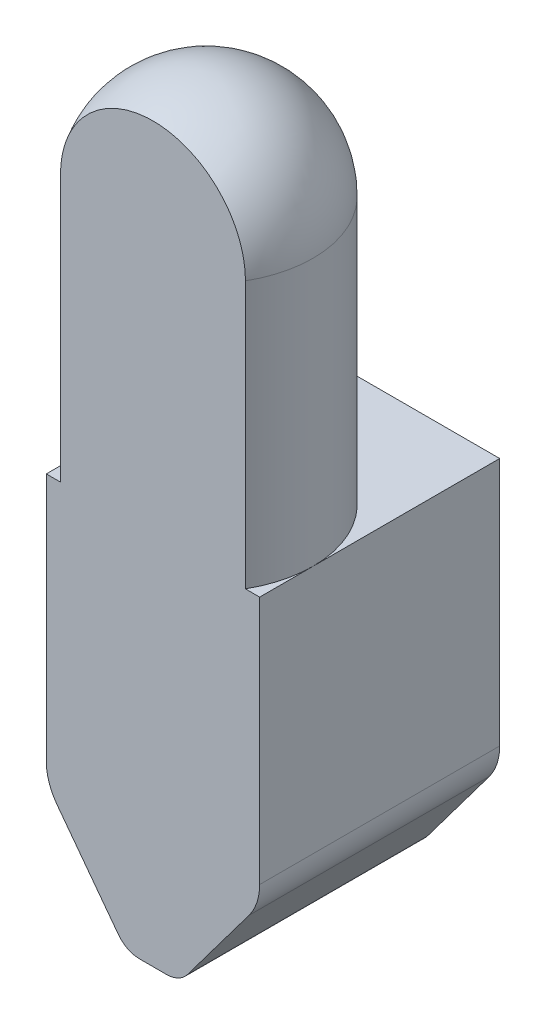
ISO-10303-21;
HEADER;
FILE_DESCRIPTION(('STEP AP214'),'2;1');
FILE_NAME('part.step','',(''),(''),'','','');
FILE_SCHEMA(('AUTOMOTIVE_DESIGN { 1 0 10303 214 1 1 1 1 }'));
ENDSEC;
DATA;
#1=APPLICATION_CONTEXT('core data for automotive mechanical design processes');
#2=APPLICATION_PROTOCOL_DEFINITION('international standard','automotive_design',2000,#1);
#3=PRODUCT_CONTEXT('',#1,'mechanical');
#4=PRODUCT('Part','Part','',(#3));
#5=PRODUCT_RELATED_PRODUCT_CATEGORY('part','',(#4));
#6=PRODUCT_DEFINITION_FORMATION('','',#4);
#7=PRODUCT_DEFINITION_CONTEXT('part definition',#1,'design');
#8=PRODUCT_DEFINITION('design','',#6,#7);
#9=PRODUCT_DEFINITION_SHAPE('','',#8);
#10=(LENGTH_UNIT() NAMED_UNIT(*) SI_UNIT(.MILLI.,.METRE.));
#11=(NAMED_UNIT(*) PLANE_ANGLE_UNIT() SI_UNIT($,.RADIAN.));
#12=(NAMED_UNIT(*) SI_UNIT($,.STERADIAN.) SOLID_ANGLE_UNIT());
#13=UNCERTAINTY_MEASURE_WITH_UNIT(LENGTH_MEASURE(1.E-05),#10,'distance_accuracy_value','');
#14=(GEOMETRIC_REPRESENTATION_CONTEXT(3) GLOBAL_UNCERTAINTY_ASSIGNED_CONTEXT((#13)) GLOBAL_UNIT_ASSIGNED_CONTEXT((#10,
#11,#12)) REPRESENTATION_CONTEXT('',''));
#15=CARTESIAN_POINT('',(0.,0.,0.));
#16=DIRECTION('',(0.,0.,1.));
#17=DIRECTION('',(1.,0.,0.));
#18=AXIS2_PLACEMENT_3D('',#15,#16,#17);
#19=CARTESIAN_POINT('',(-2.,5.,-4.5));
#20=DIRECTION('',(0.,1.,0.));
#21=DIRECTION('',(0.,0.,1.));
#22=AXIS2_PLACEMENT_3D('',#19,#20,#21);
#23=PLANE('',#22);
#24=CARTESIAN_POINT('',(0.,5.,-1.));
#25=DIRECTION('',(0.,1.,0.));
#26=DIRECTION('',(0.,0.,1.));
#27=AXIS2_PLACEMENT_3D('',#24,#25,#26);
#28=CIRCLE('',#27,2.);
#29=CARTESIAN_POINT('',(1.73205080756888,5.,0.));
#30=VERTEX_POINT('',#29);
#31=CARTESIAN_POINT('',(2.,5.,-1.));
#32=VERTEX_POINT('',#31);
#33=EDGE_CURVE('E154',#30,#32,#28,.T.);
#34=ORIENTED_EDGE('',*,*,#33,.F.);
#35=DIRECTION('',(-1.,0.,0.));
#36=VECTOR('',#35,1.);
#37=CARTESIAN_POINT('',(-2.,5.,0.));
#38=LINE('',#37,#36);
#39=CARTESIAN_POINT('',(2.,5.,0.));
#40=VERTEX_POINT('',#39);
#41=EDGE_CURVE('E147',#40,#30,#38,.T.);
#42=ORIENTED_EDGE('',*,*,#41,.F.);
#43=DIRECTION('',(0.,0.,1.));
#44=VECTOR('',#43,1.);
#45=CARTESIAN_POINT('',(2.,5.,-4.5));
#46=LINE('',#45,#44);
#47=EDGE_CURVE('E193',#32,#40,#46,.T.);
#48=ORIENTED_EDGE('',*,*,#47,.F.);
#49=EDGE_LOOP('',(#34,#42,#48));
#50=FACE_BOUND('',#49,.T.);
#51=ADVANCED_FACE('F36',(#50),#23,.T.);
#52=CARTESIAN_POINT('',(-2.,5.,-1.));
#53=VERTEX_POINT('',#52);
#54=EDGE_CURVE('E139',#32,#53,#28,.T.);
#55=ORIENTED_EDGE('',*,*,#54,.F.);
#56=CARTESIAN_POINT('',(2.,5.,-4.5));
#57=VERTEX_POINT('',#56);
#58=EDGE_CURVE('E190',#57,#32,#46,.T.);
#59=ORIENTED_EDGE('',*,*,#58,.F.);
#60=DIRECTION('',(-1.,0.,0.));
#61=VECTOR('',#60,1.);
#62=CARTESIAN_POINT('',(-2.,5.,-4.5));
#63=LINE('',#62,#61);
#64=CARTESIAN_POINT('',(-2.,5.,-4.5));
#65=VERTEX_POINT('',#64);
#66=EDGE_CURVE('E161',#57,#65,#63,.T.);
#67=ORIENTED_EDGE('',*,*,#66,.T.);
#68=DIRECTION('',(0.,0.,1.));
#69=VECTOR('',#68,1.);
#70=CARTESIAN_POINT('',(-2.,5.,-4.5));
#71=LINE('',#70,#69);
#72=EDGE_CURVE('E194',#65,#53,#71,.T.);
#73=ORIENTED_EDGE('',*,*,#72,.T.);
#74=EDGE_LOOP('',(#55,#59,#67,#73));
#75=FACE_BOUND('',#74,.T.);
#76=ADVANCED_FACE('F261',(#75),#23,.T.);
#77=CARTESIAN_POINT('',(-1.73205080756888,5.,0.));
#78=VERTEX_POINT('',#77);
#79=EDGE_CURVE('E157',#53,#78,#28,.T.);
#80=ORIENTED_EDGE('',*,*,#79,.F.);
#81=CARTESIAN_POINT('',(-2.,5.,0.));
#82=VERTEX_POINT('',#81);
#83=EDGE_CURVE('E177',#53,#82,#71,.T.);
#84=ORIENTED_EDGE('',*,*,#83,.T.);
#85=EDGE_CURVE('E160',#78,#82,#38,.T.);
#86=ORIENTED_EDGE('',*,*,#85,.F.);
#87=EDGE_LOOP('',(#80,#84,#86));
#88=FACE_BOUND('',#87,.T.);
#89=ADVANCED_FACE('F273',(#88),#23,.T.);
#90=CARTESIAN_POINT('',(2.,0.,-4.5));
#91=DIRECTION('',(1.,0.,0.));
#92=DIRECTION('',(0.,1.,0.));
#93=AXIS2_PLACEMENT_3D('',#90,#91,#92);
#94=PLANE('',#93);
#95=DIRECTION('',(0.,1.,0.));
#96=VECTOR('',#95,1.);
#97=CARTESIAN_POINT('',(2.,0.,0.));
#98=LINE('',#97,#96);
#99=CARTESIAN_POINT('',(2.,0.333333333333333,0.));
#100=VERTEX_POINT('',#99);
#101=EDGE_CURVE('E165',#100,#40,#98,.T.);
#102=ORIENTED_EDGE('',*,*,#101,.F.);
#103=DIRECTION('',(0.,0.,1.));
#104=VECTOR('',#103,1.);
#105=CARTESIAN_POINT('',(2.,0.333333333333333,-4.5));
#106=LINE('',#105,#104);
#107=CARTESIAN_POINT('',(2.,0.333333333333333,-4.5));
#108=VERTEX_POINT('',#107);
#109=EDGE_CURVE('E213',#100,#108,#106,.F.);
#110=ORIENTED_EDGE('',*,*,#109,.T.);
#111=DIRECTION('',(0.,1.,0.));
#112=VECTOR('',#111,1.);
#113=CARTESIAN_POINT('',(2.,0.,-4.5));
#114=LINE('',#113,#112);
#115=EDGE_CURVE('E175',#108,#57,#114,.T.);
#116=ORIENTED_EDGE('',*,*,#115,.T.);
#117=ORIENTED_EDGE('',*,*,#58,.T.);
#118=ORIENTED_EDGE('',*,*,#47,.T.);
#119=EDGE_LOOP('',(#102,#110,#116,#117,#118));
#120=FACE_BOUND('',#119,.T.);
#121=ADVANCED_FACE('F254',(#120),#94,.T.);
#122=CARTESIAN_POINT('',(0.5,-2.,-4.5));
#123=DIRECTION('',(0.8,-0.6,0.));
#124=DIRECTION('',(0.6,0.8,0.));
#125=AXIS2_PLACEMENT_3D('',#122,#123,#124);
#126=PLANE('',#125);
#127=DIRECTION('',(0.6,0.8,0.));
#128=VECTOR('',#127,1.);
#129=CARTESIAN_POINT('',(0.5,-2.,0.));
#130=LINE('',#129,#128);
#131=CARTESIAN_POINT('',(0.65,-1.8,0.));
#132=VERTEX_POINT('',#131);
#133=CARTESIAN_POINT('',(1.8,-0.266666666666667,0.));
#134=VERTEX_POINT('',#133);
#135=EDGE_CURVE('E187',#132,#134,#130,.T.);
#136=ORIENTED_EDGE('',*,*,#135,.F.);
#137=DIRECTION('',(0.,0.,1.));
#138=VECTOR('',#137,1.);
#139=CARTESIAN_POINT('',(0.65,-1.8,-4.5));
#140=LINE('',#139,#138);
#141=CARTESIAN_POINT('',(0.65,-1.8,-4.5));
#142=VERTEX_POINT('',#141);
#143=EDGE_CURVE('E11',#132,#142,#140,.F.);
#144=ORIENTED_EDGE('',*,*,#143,.T.);
#145=DIRECTION('',(0.6,0.8,0.));
#146=VECTOR('',#145,1.);
#147=CARTESIAN_POINT('',(0.5,-2.,-4.5));
#148=LINE('',#147,#146);
#149=CARTESIAN_POINT('',(1.8,-0.266666666666667,-4.5));
#150=VERTEX_POINT('',#149);
#151=EDGE_CURVE('E173',#142,#150,#148,.T.);
#152=ORIENTED_EDGE('',*,*,#151,.T.);
#153=DIRECTION('',(0.,0.,1.));
#154=VECTOR('',#153,1.);
#155=CARTESIAN_POINT('',(1.8,-0.266666666666667,-4.5));
#156=LINE('',#155,#154);
#157=EDGE_CURVE('E210',#150,#134,#156,.T.);
#158=ORIENTED_EDGE('',*,*,#157,.T.);
#159=EDGE_LOOP('',(#136,#144,#152,#158));
#160=FACE_BOUND('',#159,.T.);
#161=ADVANCED_FACE('F245',(#160),#126,.T.);
#162=CARTESIAN_POINT('',(-0.5,-2.,-4.5));
#163=DIRECTION('',(0.,-1.,0.));
#164=DIRECTION('',(0.,0.,-1.));
#165=AXIS2_PLACEMENT_3D('',#162,#163,#164);
#166=PLANE('',#165);
#167=DIRECTION('',(1.,0.,0.));
#168=VECTOR('',#167,1.);
#169=CARTESIAN_POINT('',(-0.5,-2.,0.));
#170=LINE('',#169,#168);
#171=CARTESIAN_POINT('',(-0.25,-2.,0.));
#172=VERTEX_POINT('',#171);
#173=CARTESIAN_POINT('',(0.25,-2.,0.));
#174=VERTEX_POINT('',#173);
#175=EDGE_CURVE('E184',#172,#174,#170,.T.);
#176=ORIENTED_EDGE('',*,*,#175,.F.);
#177=DIRECTION('',(0.,0.,1.));
#178=VECTOR('',#177,1.);
#179=CARTESIAN_POINT('',(-0.25,-2.,-4.5));
#180=LINE('',#179,#178);
#181=CARTESIAN_POINT('',(-0.25,-2.,-4.5));
#182=VERTEX_POINT('',#181);
#183=EDGE_CURVE('E225',#172,#182,#180,.F.);
#184=ORIENTED_EDGE('',*,*,#183,.T.);
#185=DIRECTION('',(1.,0.,0.));
#186=VECTOR('',#185,1.);
#187=CARTESIAN_POINT('',(-0.5,-2.,-4.5));
#188=LINE('',#187,#186);
#189=CARTESIAN_POINT('',(0.25,-2.,-4.5));
#190=VERTEX_POINT('',#189);
#191=EDGE_CURVE('E171',#182,#190,#188,.T.);
#192=ORIENTED_EDGE('',*,*,#191,.T.);
#193=DIRECTION('',(0.,0.,1.));
#194=VECTOR('',#193,1.);
#195=CARTESIAN_POINT('',(0.25,-2.,-4.5));
#196=LINE('',#195,#194);
#197=EDGE_CURVE('E222',#190,#174,#196,.T.);
#198=ORIENTED_EDGE('',*,*,#197,.T.);
#199=EDGE_LOOP('',(#176,#184,#192,#198));
#200=FACE_BOUND('',#199,.T.);
#201=ADVANCED_FACE('F241',(#200),#166,.T.);
#202=CARTESIAN_POINT('',(-0.5,-2.,-4.5));
#203=DIRECTION('',(-0.8,-0.6,0.));
#204=DIRECTION('',(0.6,-0.8,0.));
#205=AXIS2_PLACEMENT_3D('',#202,#203,#204);
#206=PLANE('',#205);
#207=DIRECTION('',(0.6,-0.8,0.));
#208=VECTOR('',#207,1.);
#209=CARTESIAN_POINT('',(-0.5,-2.,-4.5));
#210=LINE('',#209,#208);
#211=CARTESIAN_POINT('',(-1.8,-0.266666666666667,-4.5));
#212=VERTEX_POINT('',#211);
#213=CARTESIAN_POINT('',(-0.65,-1.8,-4.5));
#214=VERTEX_POINT('',#213);
#215=EDGE_CURVE('E168',#212,#214,#210,.T.);
#216=ORIENTED_EDGE('',*,*,#215,.T.);
#217=DIRECTION('',(0.,0.,1.));
#218=VECTOR('',#217,1.);
#219=CARTESIAN_POINT('',(-0.65,-1.8,-4.5));
#220=LINE('',#219,#218);
#221=CARTESIAN_POINT('',(-0.65,-1.8,0.));
#222=VERTEX_POINT('',#221);
#223=EDGE_CURVE('E215',#214,#222,#220,.T.);
#224=ORIENTED_EDGE('',*,*,#223,.T.);
#225=DIRECTION('',(0.6,-0.8,0.));
#226=VECTOR('',#225,1.);
#227=CARTESIAN_POINT('',(-0.5,-2.,0.));
#228=LINE('',#227,#226);
#229=CARTESIAN_POINT('',(-1.8,-0.266666666666667,0.));
#230=VERTEX_POINT('',#229);
#231=EDGE_CURVE('E182',#230,#222,#228,.T.);
#232=ORIENTED_EDGE('',*,*,#231,.F.);
#233=DIRECTION('',(0.,0.,1.));
#234=VECTOR('',#233,1.);
#235=CARTESIAN_POINT('',(-1.8,-0.266666666666667,-4.5));
#236=LINE('',#235,#234);
#237=EDGE_CURVE('E203',#230,#212,#236,.F.);
#238=ORIENTED_EDGE('',*,*,#237,.T.);
#239=EDGE_LOOP('',(#216,#224,#232,#238));
#240=FACE_BOUND('',#239,.T.);
#241=ADVANCED_FACE('F235',(#240),#206,.T.);
#242=CARTESIAN_POINT('',(-2.,0.,-4.5));
#243=DIRECTION('',(-1.,0.,0.));
#244=DIRECTION('',(0.,-1.,0.));
#245=AXIS2_PLACEMENT_3D('',#242,#243,#244);
#246=PLANE('',#245);
#247=DIRECTION('',(0.,-1.,0.));
#248=VECTOR('',#247,1.);
#249=CARTESIAN_POINT('',(-2.,0.,-4.5));
#250=LINE('',#249,#248);
#251=CARTESIAN_POINT('',(-2.,0.333333333333333,-4.5));
#252=VERTEX_POINT('',#251);
#253=EDGE_CURVE('E164',#65,#252,#250,.T.);
#254=ORIENTED_EDGE('',*,*,#253,.T.);
#255=DIRECTION('',(0.,0.,1.));
#256=VECTOR('',#255,1.);
#257=CARTESIAN_POINT('',(-2.,0.333333333333333,-4.5));
#258=LINE('',#257,#256);
#259=CARTESIAN_POINT('',(-2.,0.333333333333333,0.));
#260=VERTEX_POINT('',#259);
#261=EDGE_CURVE('E138',#252,#260,#258,.T.);
#262=ORIENTED_EDGE('',*,*,#261,.T.);
#263=DIRECTION('',(0.,-1.,0.));
#264=VECTOR('',#263,1.);
#265=CARTESIAN_POINT('',(-2.,0.,0.));
#266=LINE('',#265,#264);
#267=EDGE_CURVE('E179',#82,#260,#266,.T.);
#268=ORIENTED_EDGE('',*,*,#267,.F.);
#269=ORIENTED_EDGE('',*,*,#83,.F.);
#270=ORIENTED_EDGE('',*,*,#72,.F.);
#271=EDGE_LOOP('',(#254,#262,#268,#269,#270));
#272=FACE_BOUND('',#271,.T.);
#273=ADVANCED_FACE('F266',(#272),#246,.T.);
#274=CARTESIAN_POINT('',(0.,0.,-4.5));
#275=DIRECTION('',(0.,0.,1.));
#276=DIRECTION('',(1.,0.,0.));
#277=AXIS2_PLACEMENT_3D('',#274,#275,#276);
#278=PLANE('',#277);
#279=ORIENTED_EDGE('',*,*,#191,.F.);
#280=CARTESIAN_POINT('',(-0.25,-1.5,-4.5));
#281=DIRECTION('',(0.,0.,1.));
#282=DIRECTION('',(1.,0.,0.));
#283=AXIS2_PLACEMENT_3D('',#280,#281,#282);
#284=CIRCLE('',#283,0.5);
#285=EDGE_CURVE('E44',#182,#214,#284,.F.);
#286=ORIENTED_EDGE('',*,*,#285,.T.);
#287=ORIENTED_EDGE('',*,*,#215,.F.);
#288=CARTESIAN_POINT('',(-1.,0.333333333333333,-4.5));
#289=DIRECTION('',(0.,0.,1.));
#290=DIRECTION('',(1.,0.,0.));
#291=AXIS2_PLACEMENT_3D('',#288,#289,#290);
#292=CIRCLE('',#291,1.);
#293=EDGE_CURVE('E208',#212,#252,#292,.F.);
#294=ORIENTED_EDGE('',*,*,#293,.T.);
#295=ORIENTED_EDGE('',*,*,#253,.F.);
#296=ORIENTED_EDGE('',*,*,#66,.F.);
#297=ORIENTED_EDGE('',*,*,#115,.F.);
#298=CARTESIAN_POINT('',(1.,0.333333333333333,-4.5));
#299=DIRECTION('',(0.,0.,1.));
#300=DIRECTION('',(1.,0.,0.));
#301=AXIS2_PLACEMENT_3D('',#298,#299,#300);
#302=CIRCLE('',#301,1.);
#303=EDGE_CURVE('E205',#108,#150,#302,.F.);
#304=ORIENTED_EDGE('',*,*,#303,.T.);
#305=ORIENTED_EDGE('',*,*,#151,.F.);
#306=CARTESIAN_POINT('',(0.25,-1.5,-4.5));
#307=DIRECTION('',(0.,0.,1.));
#308=DIRECTION('',(1.,0.,0.));
#309=AXIS2_PLACEMENT_3D('',#306,#307,#308);
#310=CIRCLE('',#309,0.5);
#311=EDGE_CURVE('E56',#142,#190,#310,.F.);
#312=ORIENTED_EDGE('',*,*,#311,.T.);
#313=EDGE_LOOP('',(#279,#286,#287,#294,#295,#296,#297,#304,#305,#312));
#314=FACE_BOUND('',#313,.T.);
#315=ADVANCED_FACE('F229',(#314),#278,.F.);
#316=CARTESIAN_POINT('',(0.,0.,0.));
#317=DIRECTION('',(0.,0.,1.));
#318=DIRECTION('',(1.,0.,0.));
#319=AXIS2_PLACEMENT_3D('',#316,#317,#318);
#320=PLANE('',#319);
#321=ORIENTED_EDGE('',*,*,#231,.T.);
#322=CARTESIAN_POINT('',(-0.25,-1.5,0.));
#323=DIRECTION('',(0.,0.,1.));
#324=DIRECTION('',(1.,0.,0.));
#325=AXIS2_PLACEMENT_3D('',#322,#323,#324);
#326=CIRCLE('',#325,0.5);
#327=EDGE_CURVE('E220',#222,#172,#326,.T.);
#328=ORIENTED_EDGE('',*,*,#327,.T.);
#329=ORIENTED_EDGE('',*,*,#175,.T.);
#330=CARTESIAN_POINT('',(0.25,-1.5,0.));
#331=DIRECTION('',(0.,0.,1.));
#332=DIRECTION('',(1.,0.,0.));
#333=AXIS2_PLACEMENT_3D('',#330,#331,#332);
#334=CIRCLE('',#333,0.5);
#335=EDGE_CURVE('E218',#174,#132,#334,.T.);
#336=ORIENTED_EDGE('',*,*,#335,.T.);
#337=ORIENTED_EDGE('',*,*,#135,.T.);
#338=CARTESIAN_POINT('',(1.,0.333333333333333,0.));
#339=DIRECTION('',(0.,0.,1.));
#340=DIRECTION('',(1.,0.,0.));
#341=AXIS2_PLACEMENT_3D('',#338,#339,#340);
#342=CIRCLE('',#341,1.);
#343=EDGE_CURVE('E199',#134,#100,#342,.T.);
#344=ORIENTED_EDGE('',*,*,#343,.T.);
#345=ORIENTED_EDGE('',*,*,#101,.T.);
#346=ORIENTED_EDGE('',*,*,#41,.T.);
#347=DIRECTION('',(0.,-1.,0.));
#348=VECTOR('',#347,1.);
#349=CARTESIAN_POINT('',(1.73205080756888,10.,0.));
#350=LINE('',#349,#348);
#351=CARTESIAN_POINT('',(1.73205080756888,10.,0.));
#352=VERTEX_POINT('',#351);
#353=EDGE_CURVE('E143',#352,#30,#350,.T.);
#354=ORIENTED_EDGE('',*,*,#353,.F.);
#355=CARTESIAN_POINT('',(0.,10.,0.));
#356=DIRECTION('',(0.,0.,-1.));
#357=DIRECTION('',(-1.,0.,0.));
#358=AXIS2_PLACEMENT_3D('',#355,#356,#357);
#359=CIRCLE('',#358,1.73205080756888);
#360=CARTESIAN_POINT('',(-1.73205080756888,10.,0.));
#361=VERTEX_POINT('',#360);
#362=EDGE_CURVE('E130',#361,#352,#359,.T.);
#363=ORIENTED_EDGE('',*,*,#362,.F.);
#364=DIRECTION('',(0.,-1.,0.));
#365=VECTOR('',#364,1.);
#366=CARTESIAN_POINT('',(-1.73205080756888,10.,0.));
#367=LINE('',#366,#365);
#368=EDGE_CURVE('E150',#361,#78,#367,.T.);
#369=ORIENTED_EDGE('',*,*,#368,.T.);
#370=ORIENTED_EDGE('',*,*,#85,.T.);
#371=ORIENTED_EDGE('',*,*,#267,.T.);
#372=CARTESIAN_POINT('',(-1.,0.333333333333333,0.));
#373=DIRECTION('',(0.,0.,1.));
#374=DIRECTION('',(1.,0.,0.));
#375=AXIS2_PLACEMENT_3D('',#372,#373,#374);
#376=CIRCLE('',#375,1.);
#377=EDGE_CURVE('E201',#260,#230,#376,.T.);
#378=ORIENTED_EDGE('',*,*,#377,.T.);
#379=EDGE_LOOP('',(#321,#328,#329,#336,#337,#344,#345,#346,#354,#363,#369,#370,#371,#378));
#380=FACE_BOUND('',#379,.T.);
#381=ADVANCED_FACE('F145',(#380),#320,.T.);
#382=CARTESIAN_POINT('',(0.,10.,-1.));
#383=DIRECTION('',(0.,-1.,0.));
#384=DIRECTION('',(0.,0.,-1.));
#385=AXIS2_PLACEMENT_3D('',#382,#383,#384);
#386=CYLINDRICAL_SURFACE('',#385,2.);
#387=ORIENTED_EDGE('',*,*,#33,.T.);
#388=ORIENTED_EDGE('',*,*,#54,.T.);
#389=ORIENTED_EDGE('',*,*,#79,.T.);
#390=ORIENTED_EDGE('',*,*,#368,.F.);
#391=CARTESIAN_POINT('',(0.,10.,-1.));
#392=DIRECTION('',(0.,1.,0.));
#393=DIRECTION('',(0.,0.,1.));
#394=AXIS2_PLACEMENT_3D('',#391,#392,#393);
#395=CIRCLE('',#394,2.);
#396=EDGE_CURVE('E134',#352,#361,#395,.T.);
#397=ORIENTED_EDGE('',*,*,#396,.F.);
#398=ORIENTED_EDGE('',*,*,#353,.T.);
#399=EDGE_LOOP('',(#387,#388,#389,#390,#397,#398));
#400=FACE_BOUND('',#399,.T.);
#401=ADVANCED_FACE('F152',(#400),#386,.T.);
#402=CARTESIAN_POINT('',(0.,10.,-1.));
#403=DIRECTION('',(-1.,0.,0.));
#404=DIRECTION('',(0.,0.,-1.));
#405=AXIS2_PLACEMENT_3D('',#402,#403,#404);
#406=SPHERICAL_SURFACE('',#405,2.);
#407=ORIENTED_EDGE('',*,*,#396,.T.);
#408=ORIENTED_EDGE('',*,*,#362,.T.);
#409=EDGE_LOOP('',(#407,#408));
#410=FACE_BOUND('',#409,.T.);
#411=ADVANCED_FACE('F132',(#410),#406,.T.);
#412=CARTESIAN_POINT('',(-1.,0.333333333333333,-4.5));
#413=DIRECTION('',(0.,0.,1.));
#414=DIRECTION('',(1.,0.,0.));
#415=AXIS2_PLACEMENT_3D('',#412,#413,#414);
#416=CYLINDRICAL_SURFACE('',#415,1.);
#417=ORIENTED_EDGE('',*,*,#293,.F.);
#418=ORIENTED_EDGE('',*,*,#237,.F.);
#419=ORIENTED_EDGE('',*,*,#377,.F.);
#420=ORIENTED_EDGE('',*,*,#261,.F.);
#421=EDGE_LOOP('',(#417,#418,#419,#420));
#422=FACE_BOUND('',#421,.T.);
#423=ADVANCED_FACE('F270',(#422),#416,.T.);
#424=CARTESIAN_POINT('',(1.,0.333333333333333,-4.5));
#425=DIRECTION('',(0.,0.,1.));
#426=DIRECTION('',(1.,0.,0.));
#427=AXIS2_PLACEMENT_3D('',#424,#425,#426);
#428=CYLINDRICAL_SURFACE('',#427,1.);
#429=ORIENTED_EDGE('',*,*,#303,.F.);
#430=ORIENTED_EDGE('',*,*,#109,.F.);
#431=ORIENTED_EDGE('',*,*,#343,.F.);
#432=ORIENTED_EDGE('',*,*,#157,.F.);
#433=EDGE_LOOP('',(#429,#430,#431,#432));
#434=FACE_BOUND('',#433,.T.);
#435=ADVANCED_FACE('F249',(#434),#428,.T.);
#436=CARTESIAN_POINT('',(-0.25,-1.5,-4.5));
#437=DIRECTION('',(0.,0.,1.));
#438=DIRECTION('',(1.,0.,0.));
#439=AXIS2_PLACEMENT_3D('',#436,#437,#438);
#440=CYLINDRICAL_SURFACE('',#439,0.5);
#441=ORIENTED_EDGE('',*,*,#285,.F.);
#442=ORIENTED_EDGE('',*,*,#183,.F.);
#443=ORIENTED_EDGE('',*,*,#327,.F.);
#444=ORIENTED_EDGE('',*,*,#223,.F.);
#445=EDGE_LOOP('',(#441,#442,#443,#444));
#446=FACE_BOUND('',#445,.T.);
#447=ADVANCED_FACE('F238',(#446),#440,.T.);
#448=CARTESIAN_POINT('',(0.25,-1.5,-4.5));
#449=DIRECTION('',(0.,0.,1.));
#450=DIRECTION('',(1.,0.,0.));
#451=AXIS2_PLACEMENT_3D('',#448,#449,#450);
#452=CYLINDRICAL_SURFACE('',#451,0.5);
#453=ORIENTED_EDGE('',*,*,#311,.F.);
#454=ORIENTED_EDGE('',*,*,#143,.F.);
#455=ORIENTED_EDGE('',*,*,#335,.F.);
#456=ORIENTED_EDGE('',*,*,#197,.F.);
#457=EDGE_LOOP('',(#453,#454,#455,#456));
#458=FACE_BOUND('',#457,.T.);
#459=ADVANCED_FACE('F38',(#458),#452,.T.);
#460=CLOSED_SHELL('',(#51,#76,#89,#121,#161,#201,#241,#273,#315,#381,#401,#411,#423,#435,#447,#459));
#461=MANIFOLD_SOLID_BREP('B2',#460);
#462=ADVANCED_BREP_SHAPE_REPRESENTATION('',(#18,#461),#14);
#463=SHAPE_DEFINITION_REPRESENTATION(#9,#462);
ENDSEC;
END-ISO-10303-21;
